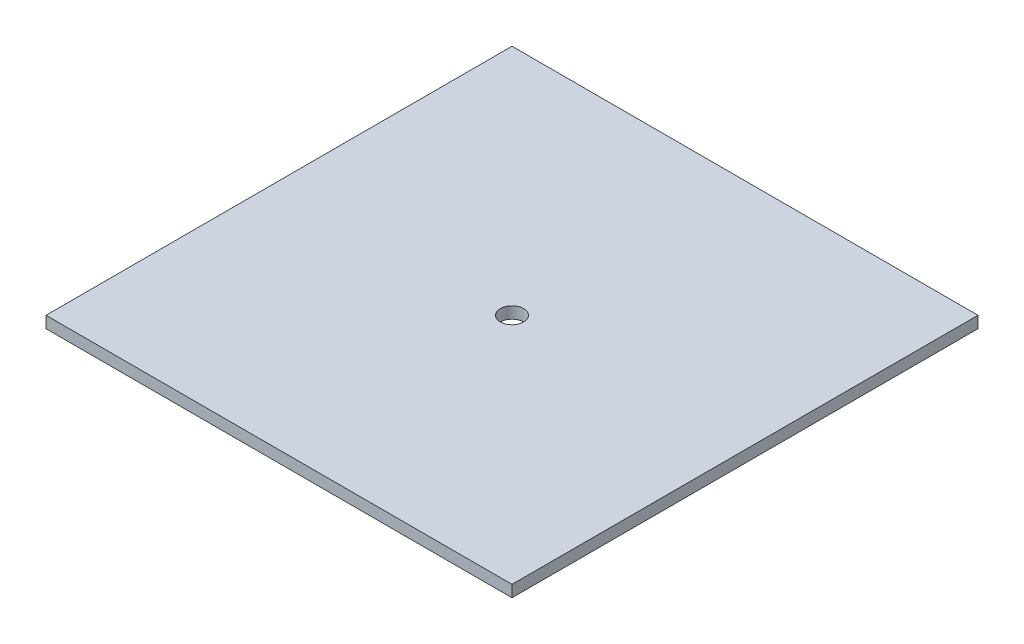
ISO-10303-21;
HEADER;
FILE_DESCRIPTION(('STEP AP214'),'2;1');
FILE_NAME('part.step','',(''),(''),'','','');
FILE_SCHEMA(('AUTOMOTIVE_DESIGN { 1 0 10303 214 1 1 1 1 }'));
ENDSEC;
DATA;
#1=APPLICATION_CONTEXT('core data for automotive mechanical design processes');
#2=APPLICATION_PROTOCOL_DEFINITION('international standard','automotive_design',2000,#1);
#3=PRODUCT_CONTEXT('',#1,'mechanical');
#4=PRODUCT('Part','Part','',(#3));
#5=PRODUCT_RELATED_PRODUCT_CATEGORY('part','',(#4));
#6=PRODUCT_DEFINITION_FORMATION('','',#4);
#7=PRODUCT_DEFINITION_CONTEXT('part definition',#1,'design');
#8=PRODUCT_DEFINITION('design','',#6,#7);
#9=PRODUCT_DEFINITION_SHAPE('','',#8);
#10=(LENGTH_UNIT() NAMED_UNIT(*) SI_UNIT(.MILLI.,.METRE.));
#11=(NAMED_UNIT(*) PLANE_ANGLE_UNIT() SI_UNIT($,.RADIAN.));
#12=(NAMED_UNIT(*) SI_UNIT($,.STERADIAN.) SOLID_ANGLE_UNIT());
#13=UNCERTAINTY_MEASURE_WITH_UNIT(LENGTH_MEASURE(1.E-05),#10,'distance_accuracy_value','');
#14=(GEOMETRIC_REPRESENTATION_CONTEXT(3) GLOBAL_UNCERTAINTY_ASSIGNED_CONTEXT((#13)) GLOBAL_UNIT_ASSIGNED_CONTEXT((#10,
#11,#12)) REPRESENTATION_CONTEXT('',''));
#15=CARTESIAN_POINT('',(0.,0.,0.));
#16=DIRECTION('',(0.,0.,1.));
#17=DIRECTION('',(1.,0.,0.));
#18=AXIS2_PLACEMENT_3D('',#15,#16,#17);
#19=CARTESIAN_POINT('',(0.,6.34999999999997,0.));
#20=DIRECTION('',(0.,1.,0.));
#21=DIRECTION('',(0.,0.,1.00000000000001));
#22=AXIS2_PLACEMENT_3D('',#19,#20,#21);
#23=PLANE('',#22);
#24=DIRECTION('',(0.,0.,-1.00000000000001));
#25=VECTOR('',#24,1.);
#26=CARTESIAN_POINT('',(127.000000000002,6.34999999999997,-127.000000000002));
#27=LINE('',#26,#25);
#28=CARTESIAN_POINT('',(127.000000000003,6.34999999999997,127.000000000002));
#29=VERTEX_POINT('',#28);
#30=CARTESIAN_POINT('',(127.000000000002,6.34999999999997,-127.000000000002));
#31=VERTEX_POINT('',#30);
#32=EDGE_CURVE('E84',#29,#31,#27,.T.);
#33=ORIENTED_EDGE('',*,*,#32,.T.);
#34=DIRECTION('',(-1.00000000000001,0.,0.));
#35=VECTOR('',#34,1.);
#36=CARTESIAN_POINT('',(-127.000000000002,6.34999999999997,-127.000000000001));
#37=LINE('',#36,#35);
#38=CARTESIAN_POINT('',(-127.000000000002,6.34999999999997,-127.000000000001));
#39=VERTEX_POINT('',#38);
#40=EDGE_CURVE('E79',#31,#39,#37,.T.);
#41=ORIENTED_EDGE('',*,*,#40,.T.);
#42=DIRECTION('',(0.,0.,1.00000000000001));
#43=VECTOR('',#42,1.);
#44=CARTESIAN_POINT('',(-127.000000000002,6.34999999999997,-127.000000000001));
#45=LINE('',#44,#43);
#46=CARTESIAN_POINT('',(-127.000000000002,6.34999999999997,127.000000000003));
#47=VERTEX_POINT('',#46);
#48=EDGE_CURVE('E82',#39,#47,#45,.T.);
#49=ORIENTED_EDGE('',*,*,#48,.T.);
#50=DIRECTION('',(1.00000000000001,0.,0.));
#51=VECTOR('',#50,1.);
#52=CARTESIAN_POINT('',(-127.000000000002,6.34999999999997,127.000000000003));
#53=LINE('',#52,#51);
#54=EDGE_CURVE('E49',#47,#29,#53,.T.);
#55=ORIENTED_EDGE('',*,*,#54,.T.);
#56=EDGE_LOOP('',(#33,#41,#49,#55));
#57=FACE_BOUND('',#56,.T.);
#58=CARTESIAN_POINT('',(0.,6.34999999999997,0.));
#59=DIRECTION('',(0.,1.,0.));
#60=DIRECTION('',(0.,0.,1.00000000000001));
#61=AXIS2_PLACEMENT_3D('',#58,#59,#60);
#62=CIRCLE('',#61,6.35);
#63=CARTESIAN_POINT('',(0.,6.34999999999997,6.35000000000011));
#64=VERTEX_POINT('',#63);
#65=EDGE_CURVE('E99',#64,#64,#62,.T.);
#66=ORIENTED_EDGE('',*,*,#65,.F.);
#67=EDGE_LOOP('',(#66));
#68=FACE_BOUND('',#67,.T.);
#69=ADVANCED_FACE('F32',(#57,#68),#23,.T.);
#70=CARTESIAN_POINT('',(0.,0.,0.));
#71=DIRECTION('',(0.,1.,0.));
#72=DIRECTION('',(0.,0.,1.00000000000001));
#73=AXIS2_PLACEMENT_3D('',#70,#71,#72);
#74=PLANE('',#73);
#75=DIRECTION('',(0.,0.,-1.00000000000001));
#76=VECTOR('',#75,1.);
#77=CARTESIAN_POINT('',(127.000000000002,0.,-127.000000000002));
#78=LINE('',#77,#76);
#79=CARTESIAN_POINT('',(127.000000000003,0.,127.000000000002));
#80=VERTEX_POINT('',#79);
#81=CARTESIAN_POINT('',(127.000000000002,0.,-127.000000000002));
#82=VERTEX_POINT('',#81);
#83=EDGE_CURVE('E96',#80,#82,#78,.T.);
#84=ORIENTED_EDGE('',*,*,#83,.F.);
#85=DIRECTION('',(1.00000000000001,0.,0.));
#86=VECTOR('',#85,1.);
#87=CARTESIAN_POINT('',(-127.000000000002,0.,127.000000000003));
#88=LINE('',#87,#86);
#89=CARTESIAN_POINT('',(-127.000000000002,0.,127.000000000003));
#90=VERTEX_POINT('',#89);
#91=EDGE_CURVE('E72',#90,#80,#88,.T.);
#92=ORIENTED_EDGE('',*,*,#91,.F.);
#93=DIRECTION('',(0.,0.,1.00000000000001));
#94=VECTOR('',#93,1.);
#95=CARTESIAN_POINT('',(-127.000000000002,0.,-127.000000000001));
#96=LINE('',#95,#94);
#97=CARTESIAN_POINT('',(-127.000000000002,0.,-127.000000000001));
#98=VERTEX_POINT('',#97);
#99=EDGE_CURVE('E66',#98,#90,#96,.T.);
#100=ORIENTED_EDGE('',*,*,#99,.F.);
#101=DIRECTION('',(-1.00000000000001,0.,0.));
#102=VECTOR('',#101,1.);
#103=CARTESIAN_POINT('',(-127.000000000002,0.,-127.000000000001));
#104=LINE('',#103,#102);
#105=EDGE_CURVE('E88',#82,#98,#104,.T.);
#106=ORIENTED_EDGE('',*,*,#105,.F.);
#107=EDGE_LOOP('',(#84,#92,#100,#106));
#108=FACE_BOUND('',#107,.T.);
#109=CARTESIAN_POINT('',(0.,0.,0.));
#110=DIRECTION('',(0.,1.,0.));
#111=DIRECTION('',(0.,0.,1.00000000000001));
#112=AXIS2_PLACEMENT_3D('',#109,#110,#111);
#113=CIRCLE('',#112,6.35);
#114=CARTESIAN_POINT('',(0.,0.,6.35000000000011));
#115=VERTEX_POINT('',#114);
#116=EDGE_CURVE('E111',#115,#115,#113,.T.);
#117=ORIENTED_EDGE('',*,*,#116,.T.);
#118=EDGE_LOOP('',(#117));
#119=FACE_BOUND('',#118,.T.);
#120=ADVANCED_FACE('F107',(#108,#119),#74,.F.);
#121=CARTESIAN_POINT('',(127.000000000002,6.34999999999997,-127.000000000002));
#122=DIRECTION('',(-1.00000000000001,0.,0.));
#123=DIRECTION('',(0.,0.,1.00000000000001));
#124=AXIS2_PLACEMENT_3D('',#121,#122,#123);
#125=PLANE('',#124);
#126=ORIENTED_EDGE('',*,*,#83,.T.);
#127=DIRECTION('',(0.,-1.,0.));
#128=VECTOR('',#127,1.);
#129=CARTESIAN_POINT('',(127.000000000002,6.34999999999997,-127.000000000002));
#130=LINE('',#129,#128);
#131=EDGE_CURVE('E11',#31,#82,#130,.T.);
#132=ORIENTED_EDGE('',*,*,#131,.F.);
#133=ORIENTED_EDGE('',*,*,#32,.F.);
#134=DIRECTION('',(0.,-1.,0.));
#135=VECTOR('',#134,1.);
#136=CARTESIAN_POINT('',(127.000000000003,6.34999999999997,127.000000000002));
#137=LINE('',#136,#135);
#138=EDGE_CURVE('E92',#29,#80,#137,.T.);
#139=ORIENTED_EDGE('',*,*,#138,.T.);
#140=EDGE_LOOP('',(#126,#132,#133,#139));
#141=FACE_BOUND('',#140,.T.);
#142=ADVANCED_FACE('F34',(#141),#125,.F.);
#143=CARTESIAN_POINT('',(-127.000000000002,6.34999999999997,-127.000000000001));
#144=DIRECTION('',(0.,0.,1.00000000000001));
#145=DIRECTION('',(1.00000000000001,0.,0.));
#146=AXIS2_PLACEMENT_3D('',#143,#144,#145);
#147=PLANE('',#146);
#148=ORIENTED_EDGE('',*,*,#105,.T.);
#149=DIRECTION('',(0.,-1.,0.));
#150=VECTOR('',#149,1.);
#151=CARTESIAN_POINT('',(-127.000000000002,6.34999999999997,-127.000000000001));
#152=LINE('',#151,#150);
#153=EDGE_CURVE('E41',#39,#98,#152,.T.);
#154=ORIENTED_EDGE('',*,*,#153,.F.);
#155=ORIENTED_EDGE('',*,*,#40,.F.);
#156=ORIENTED_EDGE('',*,*,#131,.T.);
#157=EDGE_LOOP('',(#148,#154,#155,#156));
#158=FACE_BOUND('',#157,.T.);
#159=ADVANCED_FACE('F87',(#158),#147,.F.);
#160=CARTESIAN_POINT('',(-127.000000000002,6.34999999999997,-127.000000000001));
#161=DIRECTION('',(1.00000000000001,0.,0.));
#162=DIRECTION('',(0.,0.,-1.00000000000001));
#163=AXIS2_PLACEMENT_3D('',#160,#161,#162);
#164=PLANE('',#163);
#165=ORIENTED_EDGE('',*,*,#99,.T.);
#166=DIRECTION('',(0.,-1.,0.));
#167=VECTOR('',#166,1.);
#168=CARTESIAN_POINT('',(-127.000000000002,6.34999999999997,127.000000000003));
#169=LINE('',#168,#167);
#170=EDGE_CURVE('E89',#47,#90,#169,.T.);
#171=ORIENTED_EDGE('',*,*,#170,.F.);
#172=ORIENTED_EDGE('',*,*,#48,.F.);
#173=ORIENTED_EDGE('',*,*,#153,.T.);
#174=EDGE_LOOP('',(#165,#171,#172,#173));
#175=FACE_BOUND('',#174,.T.);
#176=ADVANCED_FACE('F90',(#175),#164,.F.);
#177=CARTESIAN_POINT('',(-127.000000000002,6.34999999999997,127.000000000003));
#178=DIRECTION('',(0.,0.,-1.00000000000001));
#179=DIRECTION('',(-1.00000000000001,0.,0.));
#180=AXIS2_PLACEMENT_3D('',#177,#178,#179);
#181=PLANE('',#180);
#182=ORIENTED_EDGE('',*,*,#91,.T.);
#183=ORIENTED_EDGE('',*,*,#138,.F.);
#184=ORIENTED_EDGE('',*,*,#54,.F.);
#185=ORIENTED_EDGE('',*,*,#170,.T.);
#186=EDGE_LOOP('',(#182,#183,#184,#185));
#187=FACE_BOUND('',#186,.T.);
#188=ADVANCED_FACE('F104',(#187),#181,.F.);
#189=CARTESIAN_POINT('',(0.,6.34999999999997,0.));
#190=DIRECTION('',(0.,-1.,0.));
#191=DIRECTION('',(0.,0.,-1.00000000000001));
#192=AXIS2_PLACEMENT_3D('',#189,#190,#191);
#193=CYLINDRICAL_SURFACE('',#192,6.35);
#194=ORIENTED_EDGE('',*,*,#65,.T.);
#195=EDGE_LOOP('',(#194));
#196=FACE_BOUND('',#195,.T.);
#197=ORIENTED_EDGE('',*,*,#116,.F.);
#198=EDGE_LOOP('',(#197));
#199=FACE_BOUND('',#198,.T.);
#200=ADVANCED_FACE('F117',(#196,#199),#193,.F.);
#201=CLOSED_SHELL('',(#69,#120,#142,#159,#176,#188,#200));
#202=MANIFOLD_SOLID_BREP('B2',#201);
#203=ADVANCED_BREP_SHAPE_REPRESENTATION('',(#18,#202),#14);
#204=SHAPE_DEFINITION_REPRESENTATION(#9,#203);
ENDSEC;
END-ISO-10303-21;
